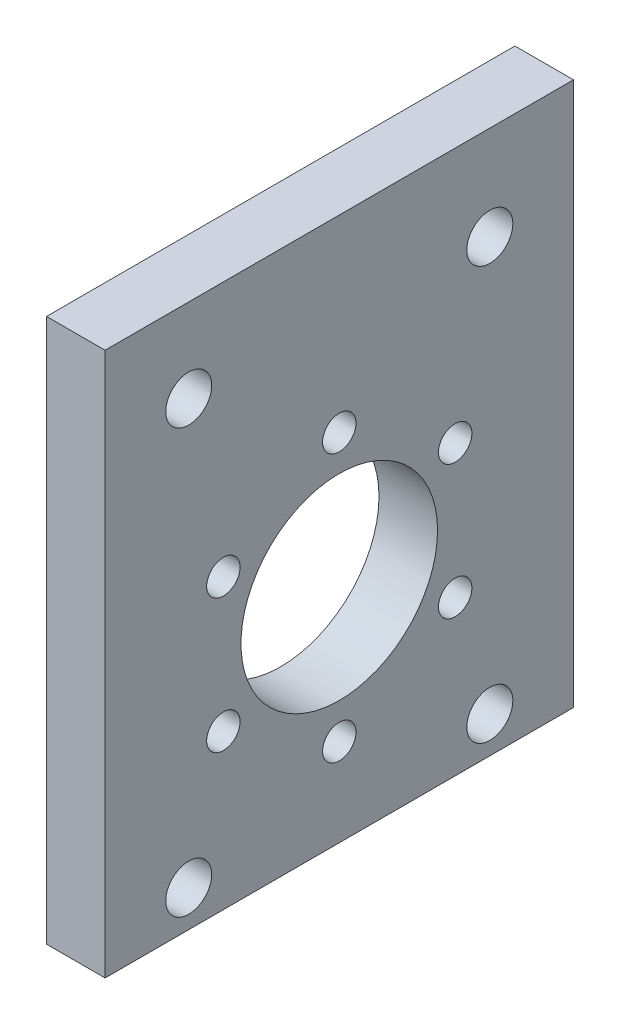
ISO-10303-21;
HEADER;
FILE_DESCRIPTION(('STEP AP214'),'2;1');
FILE_NAME('part.step','',(''),(''),'','','');
FILE_SCHEMA(('AUTOMOTIVE_DESIGN { 1 0 10303 214 1 1 1 1 }'));
ENDSEC;
DATA;
#1=APPLICATION_CONTEXT('core data for automotive mechanical design processes');
#2=APPLICATION_PROTOCOL_DEFINITION('international standard','automotive_design',2000,#1);
#3=PRODUCT_CONTEXT('',#1,'mechanical');
#4=PRODUCT('Part','Part','',(#3));
#5=PRODUCT_RELATED_PRODUCT_CATEGORY('part','',(#4));
#6=PRODUCT_DEFINITION_FORMATION('','',#4);
#7=PRODUCT_DEFINITION_CONTEXT('part definition',#1,'design');
#8=PRODUCT_DEFINITION('design','',#6,#7);
#9=PRODUCT_DEFINITION_SHAPE('','',#8);
#10=(LENGTH_UNIT() NAMED_UNIT(*) SI_UNIT(.MILLI.,.METRE.));
#11=(NAMED_UNIT(*) PLANE_ANGLE_UNIT() SI_UNIT($,.RADIAN.));
#12=(NAMED_UNIT(*) SI_UNIT($,.STERADIAN.) SOLID_ANGLE_UNIT());
#13=UNCERTAINTY_MEASURE_WITH_UNIT(LENGTH_MEASURE(1.E-05),#10,'distance_accuracy_value','');
#14=(GEOMETRIC_REPRESENTATION_CONTEXT(3) GLOBAL_UNCERTAINTY_ASSIGNED_CONTEXT((#13)) GLOBAL_UNIT_ASSIGNED_CONTEXT((#10,
#11,#12)) REPRESENTATION_CONTEXT('',''));
#15=CARTESIAN_POINT('',(0.,0.,0.));
#16=DIRECTION('',(0.,0.,1.));
#17=DIRECTION('',(1.,0.,0.));
#18=AXIS2_PLACEMENT_3D('',#15,#16,#17);
#19=CARTESIAN_POINT('',(7.,0.,0.));
#20=DIRECTION('',(0.,0.,-1.));
#21=DIRECTION('',(0.,1.,0.));
#22=AXIS2_PLACEMENT_3D('',#19,#20,#21);
#23=PLANE('',#22);
#24=DIRECTION('',(0.,-1.,0.));
#25=VECTOR('',#24,1.);
#26=CARTESIAN_POINT('',(0.,0.,0.));
#27=LINE('',#26,#25);
#28=CARTESIAN_POINT('',(0.,0.,0.));
#29=VERTEX_POINT('',#28);
#30=CARTESIAN_POINT('',(0.,-65.,0.));
#31=VERTEX_POINT('',#30);
#32=EDGE_CURVE('E105',#29,#31,#27,.T.);
#33=ORIENTED_EDGE('',*,*,#32,.T.);
#34=DIRECTION('',(-1.,0.,0.));
#35=VECTOR('',#34,1.);
#36=CARTESIAN_POINT('',(7.,-65.,0.));
#37=LINE('',#36,#35);
#38=CARTESIAN_POINT('',(7.,-65.,0.));
#39=VERTEX_POINT('',#38);
#40=EDGE_CURVE('E11',#39,#31,#37,.T.);
#41=ORIENTED_EDGE('',*,*,#40,.F.);
#42=DIRECTION('',(0.,-1.,0.));
#43=VECTOR('',#42,1.);
#44=CARTESIAN_POINT('',(7.,0.,0.));
#45=LINE('',#44,#43);
#46=CARTESIAN_POINT('',(7.,0.,0.));
#47=VERTEX_POINT('',#46);
#48=EDGE_CURVE('E89',#47,#39,#45,.T.);
#49=ORIENTED_EDGE('',*,*,#48,.F.);
#50=DIRECTION('',(-1.,0.,0.));
#51=VECTOR('',#50,1.);
#52=CARTESIAN_POINT('',(7.,0.,0.));
#53=LINE('',#52,#51);
#54=EDGE_CURVE('E96',#47,#29,#53,.T.);
#55=ORIENTED_EDGE('',*,*,#54,.T.);
#56=EDGE_LOOP('',(#33,#41,#49,#55));
#57=FACE_BOUND('',#56,.T.);
#58=ADVANCED_FACE('F39',(#57),#23,.F.);
#59=CARTESIAN_POINT('',(7.,-65.,0.));
#60=DIRECTION('',(0.,1.,0.));
#61=DIRECTION('',(0.,0.,1.));
#62=AXIS2_PLACEMENT_3D('',#59,#60,#61);
#63=PLANE('',#62);
#64=DIRECTION('',(0.,0.,-1.));
#65=VECTOR('',#64,1.);
#66=CARTESIAN_POINT('',(0.,-65.,0.));
#67=LINE('',#66,#65);
#68=CARTESIAN_POINT('',(0.,-65.,-56.));
#69=VERTEX_POINT('',#68);
#70=EDGE_CURVE('E91',#31,#69,#67,.T.);
#71=ORIENTED_EDGE('',*,*,#70,.T.);
#72=DIRECTION('',(-1.,0.,0.));
#73=VECTOR('',#72,1.);
#74=CARTESIAN_POINT('',(7.,-65.,-56.));
#75=LINE('',#74,#73);
#76=CARTESIAN_POINT('',(7.,-65.,-56.));
#77=VERTEX_POINT('',#76);
#78=EDGE_CURVE('E50',#77,#69,#75,.T.);
#79=ORIENTED_EDGE('',*,*,#78,.F.);
#80=DIRECTION('',(0.,0.,-1.));
#81=VECTOR('',#80,1.);
#82=CARTESIAN_POINT('',(7.,-65.,0.));
#83=LINE('',#82,#81);
#84=EDGE_CURVE('E83',#39,#77,#83,.T.);
#85=ORIENTED_EDGE('',*,*,#84,.F.);
#86=ORIENTED_EDGE('',*,*,#40,.T.);
#87=EDGE_LOOP('',(#71,#79,#85,#86));
#88=FACE_BOUND('',#87,.T.);
#89=ADVANCED_FACE('F94',(#88),#63,.F.);
#90=CARTESIAN_POINT('',(7.,0.,-56.));
#91=DIRECTION('',(0.,0.,1.));
#92=DIRECTION('',(0.,-1.,0.));
#93=AXIS2_PLACEMENT_3D('',#90,#91,#92);
#94=PLANE('',#93);
#95=DIRECTION('',(0.,1.,0.));
#96=VECTOR('',#95,1.);
#97=CARTESIAN_POINT('',(0.,0.,-56.));
#98=LINE('',#97,#96);
#99=CARTESIAN_POINT('',(0.,0.,-56.));
#100=VERTEX_POINT('',#99);
#101=EDGE_CURVE('E75',#69,#100,#98,.T.);
#102=ORIENTED_EDGE('',*,*,#101,.T.);
#103=DIRECTION('',(-1.,0.,0.));
#104=VECTOR('',#103,1.);
#105=CARTESIAN_POINT('',(7.,0.,-56.));
#106=LINE('',#105,#104);
#107=CARTESIAN_POINT('',(7.,0.,-56.));
#108=VERTEX_POINT('',#107);
#109=EDGE_CURVE('E93',#108,#100,#106,.T.);
#110=ORIENTED_EDGE('',*,*,#109,.F.);
#111=DIRECTION('',(0.,1.,0.));
#112=VECTOR('',#111,1.);
#113=CARTESIAN_POINT('',(7.,0.,-56.));
#114=LINE('',#113,#112);
#115=EDGE_CURVE('E88',#77,#108,#114,.T.);
#116=ORIENTED_EDGE('',*,*,#115,.F.);
#117=ORIENTED_EDGE('',*,*,#78,.T.);
#118=EDGE_LOOP('',(#102,#110,#116,#117));
#119=FACE_BOUND('',#118,.T.);
#120=ADVANCED_FACE('F98',(#119),#94,.F.);
#121=CARTESIAN_POINT('',(7.,0.,0.));
#122=DIRECTION('',(0.,-1.,0.));
#123=DIRECTION('',(0.,0.,-1.));
#124=AXIS2_PLACEMENT_3D('',#121,#122,#123);
#125=PLANE('',#124);
#126=DIRECTION('',(0.,0.,1.));
#127=VECTOR('',#126,1.);
#128=CARTESIAN_POINT('',(0.,0.,0.));
#129=LINE('',#128,#127);
#130=EDGE_CURVE('E76',#100,#29,#129,.T.);
#131=ORIENTED_EDGE('',*,*,#130,.T.);
#132=ORIENTED_EDGE('',*,*,#54,.F.);
#133=DIRECTION('',(0.,0.,1.));
#134=VECTOR('',#133,1.);
#135=CARTESIAN_POINT('',(7.,0.,0.));
#136=LINE('',#135,#134);
#137=EDGE_CURVE('E54',#108,#47,#136,.T.);
#138=ORIENTED_EDGE('',*,*,#137,.F.);
#139=ORIENTED_EDGE('',*,*,#109,.T.);
#140=EDGE_LOOP('',(#131,#132,#138,#139));
#141=FACE_BOUND('',#140,.T.);
#142=ADVANCED_FACE('F109',(#141),#125,.F.);
#143=CARTESIAN_POINT('',(7.,0.,0.));
#144=DIRECTION('',(1.,0.,0.));
#145=DIRECTION('',(0.,0.,-1.));
#146=AXIS2_PLACEMENT_3D('',#143,#144,#145);
#147=PLANE('',#146);
#148=CARTESIAN_POINT('',(7.,-60.6477072006174,-46.));
#149=DIRECTION('',(1.,0.,0.));
#150=DIRECTION('',(0.,0.,-1.));
#151=AXIS2_PLACEMENT_3D('',#148,#149,#150);
#152=CIRCLE('',#151,2.75000000000018);
#153=CARTESIAN_POINT('',(7.,-60.6477072006174,-48.7500000000002));
#154=VERTEX_POINT('',#153);
#155=EDGE_CURVE('E170',#154,#154,#152,.T.);
#156=ORIENTED_EDGE('',*,*,#155,.F.);
#157=EDGE_LOOP('',(#156));
#158=FACE_BOUND('',#157,.T.);
#159=CARTESIAN_POINT('',(7.,-11.256698368964,-46.));
#160=DIRECTION('',(1.,0.,0.));
#161=DIRECTION('',(0.,0.,-1.));
#162=AXIS2_PLACEMENT_3D('',#159,#160,#161);
#163=CIRCLE('',#162,2.75000000000018);
#164=CARTESIAN_POINT('',(7.,-11.256698368964,-48.7500000000002));
#165=VERTEX_POINT('',#164);
#166=EDGE_CURVE('E173',#165,#165,#163,.T.);
#167=ORIENTED_EDGE('',*,*,#166,.F.);
#168=EDGE_LOOP('',(#167));
#169=FACE_BOUND('',#168,.T.);
#170=CARTESIAN_POINT('',(7.,-9.99852659719802,-10.));
#171=DIRECTION('',(1.,0.,0.));
#172=DIRECTION('',(0.,0.,-1.));
#173=AXIS2_PLACEMENT_3D('',#170,#171,#172);
#174=CIRCLE('',#173,2.75000000000018);
#175=CARTESIAN_POINT('',(7.,-9.99852659719802,-12.7500000000002));
#176=VERTEX_POINT('',#175);
#177=EDGE_CURVE('E163',#176,#176,#174,.T.);
#178=ORIENTED_EDGE('',*,*,#177,.F.);
#179=EDGE_LOOP('',(#178));
#180=FACE_BOUND('',#179,.T.);
#181=CARTESIAN_POINT('',(7.,-60.6477072006174,-10.));
#182=DIRECTION('',(1.,0.,0.));
#183=DIRECTION('',(0.,0.,-1.));
#184=AXIS2_PLACEMENT_3D('',#181,#182,#183);
#185=CIRCLE('',#184,2.75000000000018);
#186=CARTESIAN_POINT('',(7.,-60.6477072006174,-12.7500000000002));
#187=VERTEX_POINT('',#186);
#188=EDGE_CURVE('E159',#187,#187,#185,.T.);
#189=ORIENTED_EDGE('',*,*,#188,.F.);
#190=EDGE_LOOP('',(#189));
#191=FACE_BOUND('',#190,.T.);
#192=CARTESIAN_POINT('',(7.,-46.5199999999838,-41.8564064605813));
#193=DIRECTION('',(-1.,0.,0.));
#194=DIRECTION('',(0.,0.,1.));
#195=AXIS2_PLACEMENT_3D('',#192,#193,#194);
#196=CIRCLE('',#195,1.99999999999992);
#197=CARTESIAN_POINT('',(7.,-46.5199999999838,-39.8564064605814));
#198=VERTEX_POINT('',#197);
#199=EDGE_CURVE('E129',#198,#198,#196,.T.);
#200=ORIENTED_EDGE('',*,*,#199,.T.);
#201=EDGE_LOOP('',(#200));
#202=FACE_BOUND('',#201,.T.);
#203=CARTESIAN_POINT('',(7.,-54.5199999999839,-28.0000000000303));
#204=DIRECTION('',(-1.,0.,0.));
#205=DIRECTION('',(0.,0.,1.));
#206=AXIS2_PLACEMENT_3D('',#203,#204,#205);
#207=CIRCLE('',#206,1.99999999999992);
#208=CARTESIAN_POINT('',(7.,-54.5199999999839,-26.0000000000304));
#209=VERTEX_POINT('',#208);
#210=EDGE_CURVE('E134',#209,#209,#207,.T.);
#211=ORIENTED_EDGE('',*,*,#210,.T.);
#212=EDGE_LOOP('',(#211));
#213=FACE_BOUND('',#212,.T.);
#214=CARTESIAN_POINT('',(7.,-46.5199999999838,-14.1435935394792));
#215=DIRECTION('',(-1.,0.,0.));
#216=DIRECTION('',(0.,0.,1.));
#217=AXIS2_PLACEMENT_3D('',#214,#215,#216);
#218=CIRCLE('',#217,1.99999999999992);
#219=CARTESIAN_POINT('',(7.,-46.5199999999838,-12.1435935394792));
#220=VERTEX_POINT('',#219);
#221=EDGE_CURVE('E142',#220,#220,#218,.T.);
#222=ORIENTED_EDGE('',*,*,#221,.T.);
#223=EDGE_LOOP('',(#222));
#224=FACE_BOUND('',#223,.T.);
#225=CARTESIAN_POINT('',(7.,-30.5199999999838,-14.1435935394792));
#226=DIRECTION('',(-1.,0.,0.));
#227=DIRECTION('',(0.,0.,1.));
#228=AXIS2_PLACEMENT_3D('',#225,#226,#227);
#229=CIRCLE('',#228,1.99999999999992);
#230=CARTESIAN_POINT('',(7.,-30.5199999999838,-12.1435935394793));
#231=VERTEX_POINT('',#230);
#232=EDGE_CURVE('E150',#231,#231,#229,.T.);
#233=ORIENTED_EDGE('',*,*,#232,.T.);
#234=EDGE_LOOP('',(#233));
#235=FACE_BOUND('',#234,.T.);
#236=CARTESIAN_POINT('',(7.,-22.5199999999839,-28.0000000000303));
#237=DIRECTION('',(-1.,0.,0.));
#238=DIRECTION('',(0.,0.,1.));
#239=AXIS2_PLACEMENT_3D('',#236,#237,#238);
#240=CIRCLE('',#239,1.99999999999992);
#241=CARTESIAN_POINT('',(7.,-22.5199999999839,-26.0000000000304));
#242=VERTEX_POINT('',#241);
#243=EDGE_CURVE('E153',#242,#242,#240,.T.);
#244=ORIENTED_EDGE('',*,*,#243,.T.);
#245=EDGE_LOOP('',(#244));
#246=FACE_BOUND('',#245,.T.);
#247=CARTESIAN_POINT('',(7.,-30.519999999984,-41.8564064605813));
#248=DIRECTION('',(-1.,0.,0.));
#249=DIRECTION('',(0.,0.,1.));
#250=AXIS2_PLACEMENT_3D('',#247,#248,#249);
#251=CIRCLE('',#250,1.99999999999992);
#252=CARTESIAN_POINT('',(7.,-30.519999999984,-39.8564064605814));
#253=VERTEX_POINT('',#252);
#254=EDGE_CURVE('E118',#253,#253,#251,.T.);
#255=ORIENTED_EDGE('',*,*,#254,.T.);
#256=EDGE_LOOP('',(#255));
#257=FACE_BOUND('',#256,.T.);
#258=CARTESIAN_POINT('',(7.,-38.52,-28.));
#259=DIRECTION('',(1.,0.,0.));
#260=DIRECTION('',(0.,0.,-1.));
#261=AXIS2_PLACEMENT_3D('',#258,#259,#260);
#262=CIRCLE('',#261,11.75);
#263=CARTESIAN_POINT('',(7.,-38.52,-39.75));
#264=VERTEX_POINT('',#263);
#265=EDGE_CURVE('E116',#264,#264,#262,.T.);
#266=ORIENTED_EDGE('',*,*,#265,.F.);
#267=EDGE_LOOP('',(#266));
#268=FACE_BOUND('',#267,.T.);
#269=ORIENTED_EDGE('',*,*,#48,.T.);
#270=ORIENTED_EDGE('',*,*,#84,.T.);
#271=ORIENTED_EDGE('',*,*,#115,.T.);
#272=ORIENTED_EDGE('',*,*,#137,.T.);
#273=EDGE_LOOP('',(#269,#270,#271,#272));
#274=FACE_BOUND('',#273,.T.);
#275=ADVANCED_FACE('F86',(#158,#169,#180,#191,#202,#213,#224,#235,#246,#257,#268,#274),#147,.T.);
#276=CARTESIAN_POINT('',(0.,0.,0.));
#277=DIRECTION('',(1.,0.,0.));
#278=DIRECTION('',(0.,0.,-1.));
#279=AXIS2_PLACEMENT_3D('',#276,#277,#278);
#280=PLANE('',#279);
#281=CARTESIAN_POINT('',(0.,-60.6477072006174,-46.));
#282=DIRECTION('',(1.,0.,0.));
#283=DIRECTION('',(0.,0.,-1.));
#284=AXIS2_PLACEMENT_3D('',#281,#282,#283);
#285=CIRCLE('',#284,2.75000000000018);
#286=CARTESIAN_POINT('',(0.,-60.6477072006174,-48.7500000000002));
#287=VERTEX_POINT('',#286);
#288=EDGE_CURVE('E165',#287,#287,#285,.T.);
#289=ORIENTED_EDGE('',*,*,#288,.T.);
#290=EDGE_LOOP('',(#289));
#291=FACE_BOUND('',#290,.T.);
#292=CARTESIAN_POINT('',(0.,-11.256698368964,-46.));
#293=DIRECTION('',(1.,0.,0.));
#294=DIRECTION('',(0.,0.,-1.));
#295=AXIS2_PLACEMENT_3D('',#292,#293,#294);
#296=CIRCLE('',#295,2.75000000000018);
#297=CARTESIAN_POINT('',(0.,-11.256698368964,-48.7500000000002));
#298=VERTEX_POINT('',#297);
#299=EDGE_CURVE('E167',#298,#298,#296,.T.);
#300=ORIENTED_EDGE('',*,*,#299,.T.);
#301=EDGE_LOOP('',(#300));
#302=FACE_BOUND('',#301,.T.);
#303=CARTESIAN_POINT('',(0.,-9.99852659719802,-10.));
#304=DIRECTION('',(1.,0.,0.));
#305=DIRECTION('',(0.,0.,-1.));
#306=AXIS2_PLACEMENT_3D('',#303,#304,#305);
#307=CIRCLE('',#306,2.75000000000018);
#308=CARTESIAN_POINT('',(0.,-9.99852659719802,-12.7500000000002));
#309=VERTEX_POINT('',#308);
#310=EDGE_CURVE('E176',#309,#309,#307,.T.);
#311=ORIENTED_EDGE('',*,*,#310,.T.);
#312=EDGE_LOOP('',(#311));
#313=FACE_BOUND('',#312,.T.);
#314=CARTESIAN_POINT('',(0.,-60.6477072006174,-10.));
#315=DIRECTION('',(1.,0.,0.));
#316=DIRECTION('',(0.,0.,-1.));
#317=AXIS2_PLACEMENT_3D('',#314,#315,#316);
#318=CIRCLE('',#317,2.75000000000018);
#319=CARTESIAN_POINT('',(0.,-60.6477072006174,-12.7500000000002));
#320=VERTEX_POINT('',#319);
#321=EDGE_CURVE('E135',#320,#320,#318,.T.);
#322=ORIENTED_EDGE('',*,*,#321,.T.);
#323=EDGE_LOOP('',(#322));
#324=FACE_BOUND('',#323,.T.);
#325=CARTESIAN_POINT('',(0.,-46.5199999999838,-41.8564064605813));
#326=DIRECTION('',(-1.,0.,0.));
#327=DIRECTION('',(0.,0.,1.));
#328=AXIS2_PLACEMENT_3D('',#325,#326,#327);
#329=CIRCLE('',#328,1.99999999999992);
#330=CARTESIAN_POINT('',(0.,-46.5199999999838,-39.8564064605814));
#331=VERTEX_POINT('',#330);
#332=EDGE_CURVE('E131',#331,#331,#329,.T.);
#333=ORIENTED_EDGE('',*,*,#332,.F.);
#334=EDGE_LOOP('',(#333));
#335=FACE_BOUND('',#334,.T.);
#336=CARTESIAN_POINT('',(0.,-54.5199999999839,-28.0000000000303));
#337=DIRECTION('',(-1.,0.,0.));
#338=DIRECTION('',(0.,0.,1.));
#339=AXIS2_PLACEMENT_3D('',#336,#337,#338);
#340=CIRCLE('',#339,1.99999999999992);
#341=CARTESIAN_POINT('',(0.,-54.5199999999839,-26.0000000000304));
#342=VERTEX_POINT('',#341);
#343=EDGE_CURVE('E139',#342,#342,#340,.T.);
#344=ORIENTED_EDGE('',*,*,#343,.F.);
#345=EDGE_LOOP('',(#344));
#346=FACE_BOUND('',#345,.T.);
#347=CARTESIAN_POINT('',(0.,-46.5199999999838,-14.1435935394792));
#348=DIRECTION('',(-1.,0.,0.));
#349=DIRECTION('',(0.,0.,1.));
#350=AXIS2_PLACEMENT_3D('',#347,#348,#349);
#351=CIRCLE('',#350,1.99999999999992);
#352=CARTESIAN_POINT('',(0.,-46.5199999999838,-12.1435935394792));
#353=VERTEX_POINT('',#352);
#354=EDGE_CURVE('E144',#353,#353,#351,.T.);
#355=ORIENTED_EDGE('',*,*,#354,.F.);
#356=EDGE_LOOP('',(#355));
#357=FACE_BOUND('',#356,.T.);
#358=CARTESIAN_POINT('',(0.,-30.5199999999838,-14.1435935394792));
#359=DIRECTION('',(-1.,0.,0.));
#360=DIRECTION('',(0.,0.,1.));
#361=AXIS2_PLACEMENT_3D('',#358,#359,#360);
#362=CIRCLE('',#361,1.99999999999992);
#363=CARTESIAN_POINT('',(0.,-30.5199999999838,-12.1435935394793));
#364=VERTEX_POINT('',#363);
#365=EDGE_CURVE('E148',#364,#364,#362,.T.);
#366=ORIENTED_EDGE('',*,*,#365,.F.);
#367=EDGE_LOOP('',(#366));
#368=FACE_BOUND('',#367,.T.);
#369=CARTESIAN_POINT('',(0.,-22.5199999999839,-28.0000000000303));
#370=DIRECTION('',(-1.,0.,0.));
#371=DIRECTION('',(0.,0.,1.));
#372=AXIS2_PLACEMENT_3D('',#369,#370,#371);
#373=CIRCLE('',#372,1.99999999999992);
#374=CARTESIAN_POINT('',(0.,-22.5199999999839,-26.0000000000304));
#375=VERTEX_POINT('',#374);
#376=EDGE_CURVE('E123',#375,#375,#373,.T.);
#377=ORIENTED_EDGE('',*,*,#376,.F.);
#378=EDGE_LOOP('',(#377));
#379=FACE_BOUND('',#378,.T.);
#380=CARTESIAN_POINT('',(0.,-30.519999999984,-41.8564064605813));
#381=DIRECTION('',(-1.,0.,0.));
#382=DIRECTION('',(0.,0.,1.));
#383=AXIS2_PLACEMENT_3D('',#380,#381,#382);
#384=CIRCLE('',#383,1.99999999999992);
#385=CARTESIAN_POINT('',(0.,-30.519999999984,-39.8564064605814));
#386=VERTEX_POINT('',#385);
#387=EDGE_CURVE('E125',#386,#386,#384,.T.);
#388=ORIENTED_EDGE('',*,*,#387,.F.);
#389=EDGE_LOOP('',(#388));
#390=FACE_BOUND('',#389,.T.);
#391=CARTESIAN_POINT('',(0.,-38.52,-28.));
#392=DIRECTION('',(1.,0.,0.));
#393=DIRECTION('',(0.,0.,-1.));
#394=AXIS2_PLACEMENT_3D('',#391,#392,#393);
#395=CIRCLE('',#394,11.75);
#396=CARTESIAN_POINT('',(0.,-38.52,-39.75));
#397=VERTEX_POINT('',#396);
#398=EDGE_CURVE('E102',#397,#397,#395,.T.);
#399=ORIENTED_EDGE('',*,*,#398,.T.);
#400=EDGE_LOOP('',(#399));
#401=FACE_BOUND('',#400,.T.);
#402=ORIENTED_EDGE('',*,*,#32,.F.);
#403=ORIENTED_EDGE('',*,*,#130,.F.);
#404=ORIENTED_EDGE('',*,*,#101,.F.);
#405=ORIENTED_EDGE('',*,*,#70,.F.);
#406=EDGE_LOOP('',(#402,#403,#404,#405));
#407=FACE_BOUND('',#406,.T.);
#408=ADVANCED_FACE('F113',(#291,#302,#313,#324,#335,#346,#357,#368,#379,#390,#401,#407),#280,.F.);
#409=CARTESIAN_POINT('',(0.,-38.52,-28.));
#410=DIRECTION('',(1.,0.,0.));
#411=DIRECTION('',(0.,0.,-1.));
#412=AXIS2_PLACEMENT_3D('',#409,#410,#411);
#413=CYLINDRICAL_SURFACE('',#412,11.75);
#414=ORIENTED_EDGE('',*,*,#398,.F.);
#415=EDGE_LOOP('',(#414));
#416=FACE_BOUND('',#415,.T.);
#417=ORIENTED_EDGE('',*,*,#265,.T.);
#418=EDGE_LOOP('',(#417));
#419=FACE_BOUND('',#418,.T.);
#420=ADVANCED_FACE('F201',(#416,#419),#413,.F.);
#421=CARTESIAN_POINT('',(7.,-30.519999999984,-41.8564064605813));
#422=DIRECTION('',(-1.,0.,0.));
#423=DIRECTION('',(0.,0.,1.));
#424=AXIS2_PLACEMENT_3D('',#421,#422,#423);
#425=CYLINDRICAL_SURFACE('',#424,1.99999999999992);
#426=ORIENTED_EDGE('',*,*,#254,.F.);
#427=EDGE_LOOP('',(#426));
#428=FACE_BOUND('',#427,.T.);
#429=ORIENTED_EDGE('',*,*,#387,.T.);
#430=EDGE_LOOP('',(#429));
#431=FACE_BOUND('',#430,.T.);
#432=ADVANCED_FACE('F207',(#428,#431),#425,.F.);
#433=CARTESIAN_POINT('',(7.,-22.5199999999839,-28.0000000000303));
#434=DIRECTION('',(-1.,0.,0.));
#435=DIRECTION('',(0.,0.,1.));
#436=AXIS2_PLACEMENT_3D('',#433,#434,#435);
#437=CYLINDRICAL_SURFACE('',#436,1.99999999999992);
#438=ORIENTED_EDGE('',*,*,#243,.F.);
#439=EDGE_LOOP('',(#438));
#440=FACE_BOUND('',#439,.T.);
#441=ORIENTED_EDGE('',*,*,#376,.T.);
#442=EDGE_LOOP('',(#441));
#443=FACE_BOUND('',#442,.T.);
#444=ADVANCED_FACE('F214',(#440,#443),#437,.F.);
#445=CARTESIAN_POINT('',(7.,-30.5199999999838,-14.1435935394792));
#446=DIRECTION('',(-1.,0.,0.));
#447=DIRECTION('',(0.,0.,1.));
#448=AXIS2_PLACEMENT_3D('',#445,#446,#447);
#449=CYLINDRICAL_SURFACE('',#448,1.99999999999992);
#450=ORIENTED_EDGE('',*,*,#232,.F.);
#451=EDGE_LOOP('',(#450));
#452=FACE_BOUND('',#451,.T.);
#453=ORIENTED_EDGE('',*,*,#365,.T.);
#454=EDGE_LOOP('',(#453));
#455=FACE_BOUND('',#454,.T.);
#456=ADVANCED_FACE('F271',(#452,#455),#449,.F.);
#457=CARTESIAN_POINT('',(7.,-46.5199999999838,-14.1435935394792));
#458=DIRECTION('',(-1.,0.,0.));
#459=DIRECTION('',(0.,0.,1.));
#460=AXIS2_PLACEMENT_3D('',#457,#458,#459);
#461=CYLINDRICAL_SURFACE('',#460,1.99999999999992);
#462=ORIENTED_EDGE('',*,*,#221,.F.);
#463=EDGE_LOOP('',(#462));
#464=FACE_BOUND('',#463,.T.);
#465=ORIENTED_EDGE('',*,*,#354,.T.);
#466=EDGE_LOOP('',(#465));
#467=FACE_BOUND('',#466,.T.);
#468=ADVANCED_FACE('F285',(#464,#467),#461,.F.);
#469=CARTESIAN_POINT('',(7.,-54.5199999999839,-28.0000000000303));
#470=DIRECTION('',(-1.,0.,0.));
#471=DIRECTION('',(0.,0.,1.));
#472=AXIS2_PLACEMENT_3D('',#469,#470,#471);
#473=CYLINDRICAL_SURFACE('',#472,1.99999999999992);
#474=ORIENTED_EDGE('',*,*,#210,.F.);
#475=EDGE_LOOP('',(#474));
#476=FACE_BOUND('',#475,.T.);
#477=ORIENTED_EDGE('',*,*,#343,.T.);
#478=EDGE_LOOP('',(#477));
#479=FACE_BOUND('',#478,.T.);
#480=ADVANCED_FACE('F293',(#476,#479),#473,.F.);
#481=CARTESIAN_POINT('',(7.,-46.5199999999838,-41.8564064605813));
#482=DIRECTION('',(-1.,0.,0.));
#483=DIRECTION('',(0.,0.,1.));
#484=AXIS2_PLACEMENT_3D('',#481,#482,#483);
#485=CYLINDRICAL_SURFACE('',#484,1.99999999999992);
#486=ORIENTED_EDGE('',*,*,#199,.F.);
#487=EDGE_LOOP('',(#486));
#488=FACE_BOUND('',#487,.T.);
#489=ORIENTED_EDGE('',*,*,#332,.T.);
#490=EDGE_LOOP('',(#489));
#491=FACE_BOUND('',#490,.T.);
#492=ADVANCED_FACE('F297',(#488,#491),#485,.F.);
#493=CARTESIAN_POINT('',(0.,-60.6477072006174,-10.));
#494=DIRECTION('',(1.,0.,0.));
#495=DIRECTION('',(0.,0.,-1.));
#496=AXIS2_PLACEMENT_3D('',#493,#494,#495);
#497=CYLINDRICAL_SURFACE('',#496,2.75000000000018);
#498=ORIENTED_EDGE('',*,*,#321,.F.);
#499=EDGE_LOOP('',(#498));
#500=FACE_BOUND('',#499,.T.);
#501=ORIENTED_EDGE('',*,*,#188,.T.);
#502=EDGE_LOOP('',(#501));
#503=FACE_BOUND('',#502,.T.);
#504=ADVANCED_FACE('F307',(#500,#503),#497,.F.);
#505=CARTESIAN_POINT('',(0.,-9.99852659719802,-10.));
#506=DIRECTION('',(1.,0.,0.));
#507=DIRECTION('',(0.,0.,-1.));
#508=AXIS2_PLACEMENT_3D('',#505,#506,#507);
#509=CYLINDRICAL_SURFACE('',#508,2.75000000000018);
#510=ORIENTED_EDGE('',*,*,#310,.F.);
#511=EDGE_LOOP('',(#510));
#512=FACE_BOUND('',#511,.T.);
#513=ORIENTED_EDGE('',*,*,#177,.T.);
#514=EDGE_LOOP('',(#513));
#515=FACE_BOUND('',#514,.T.);
#516=ADVANCED_FACE('F185',(#512,#515),#509,.F.);
#517=CARTESIAN_POINT('',(0.,-11.256698368964,-46.));
#518=DIRECTION('',(1.,0.,0.));
#519=DIRECTION('',(0.,0.,-1.));
#520=AXIS2_PLACEMENT_3D('',#517,#518,#519);
#521=CYLINDRICAL_SURFACE('',#520,2.75000000000018);
#522=ORIENTED_EDGE('',*,*,#299,.F.);
#523=EDGE_LOOP('',(#522));
#524=FACE_BOUND('',#523,.T.);
#525=ORIENTED_EDGE('',*,*,#166,.T.);
#526=EDGE_LOOP('',(#525));
#527=FACE_BOUND('',#526,.T.);
#528=ADVANCED_FACE('F326',(#524,#527),#521,.F.);
#529=CARTESIAN_POINT('',(0.,-60.6477072006174,-46.));
#530=DIRECTION('',(1.,0.,0.));
#531=DIRECTION('',(0.,0.,-1.));
#532=AXIS2_PLACEMENT_3D('',#529,#530,#531);
#533=CYLINDRICAL_SURFACE('',#532,2.75000000000018);
#534=ORIENTED_EDGE('',*,*,#288,.F.);
#535=EDGE_LOOP('',(#534));
#536=FACE_BOUND('',#535,.T.);
#537=ORIENTED_EDGE('',*,*,#155,.T.);
#538=EDGE_LOOP('',(#537));
#539=FACE_BOUND('',#538,.T.);
#540=ADVANCED_FACE('F333',(#536,#539),#533,.F.);
#541=CLOSED_SHELL('',(#58,#89,#120,#142,#275,#408,#420,#432,#444,#456,#468,#480,#492,#504,#516,
#528,#540));
#542=MANIFOLD_SOLID_BREP('B2',#541);
#543=ADVANCED_BREP_SHAPE_REPRESENTATION('',(#18,#542),#14);
#544=SHAPE_DEFINITION_REPRESENTATION(#9,#543);
ENDSEC;
END-ISO-10303-21;
